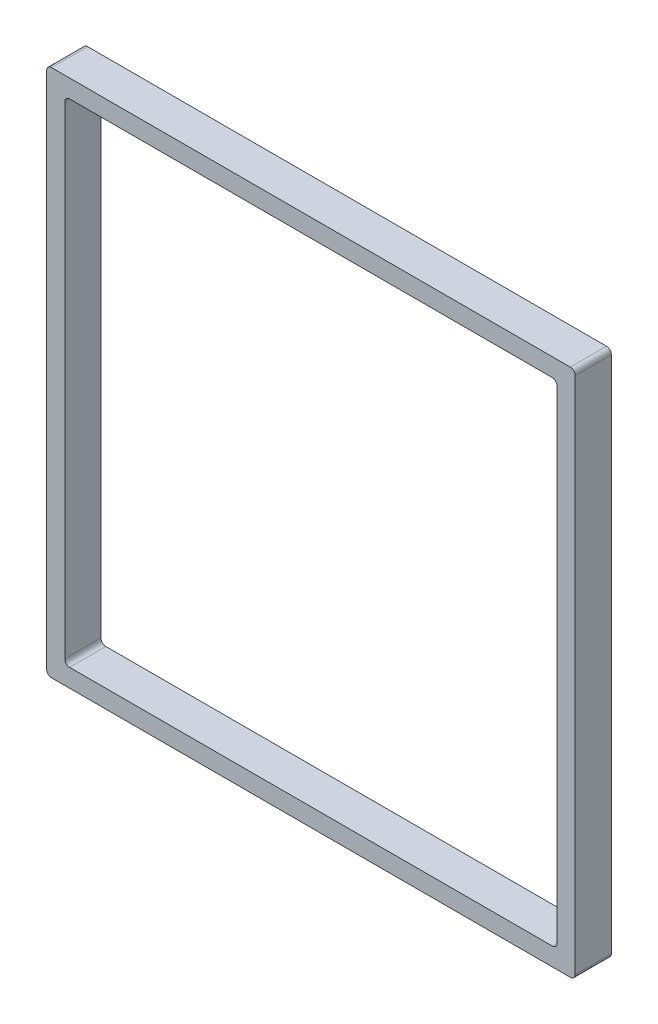
ISO-10303-21;
HEADER;
FILE_DESCRIPTION(('STEP AP214'),'2;1');
FILE_NAME('part.step','',(''),(''),'','','');
FILE_SCHEMA(('AUTOMOTIVE_DESIGN { 1 0 10303 214 1 1 1 1 }'));
ENDSEC;
DATA;
#1=APPLICATION_CONTEXT('core data for automotive mechanical design processes');
#2=APPLICATION_PROTOCOL_DEFINITION('international standard','automotive_design',2000,#1);
#3=PRODUCT_CONTEXT('',#1,'mechanical');
#4=PRODUCT('Part','Part','',(#3));
#5=PRODUCT_RELATED_PRODUCT_CATEGORY('part','',(#4));
#6=PRODUCT_DEFINITION_FORMATION('','',#4);
#7=PRODUCT_DEFINITION_CONTEXT('part definition',#1,'design');
#8=PRODUCT_DEFINITION('design','',#6,#7);
#9=PRODUCT_DEFINITION_SHAPE('','',#8);
#10=(LENGTH_UNIT() NAMED_UNIT(*) SI_UNIT(.MILLI.,.METRE.));
#11=(NAMED_UNIT(*) PLANE_ANGLE_UNIT() SI_UNIT($,.RADIAN.));
#12=(NAMED_UNIT(*) SI_UNIT($,.STERADIAN.) SOLID_ANGLE_UNIT());
#13=UNCERTAINTY_MEASURE_WITH_UNIT(LENGTH_MEASURE(1.E-05),#10,'distance_accuracy_value','');
#14=(GEOMETRIC_REPRESENTATION_CONTEXT(3) GLOBAL_UNCERTAINTY_ASSIGNED_CONTEXT((#13)) GLOBAL_UNIT_ASSIGNED_CONTEXT((#10,
#11,#12)) REPRESENTATION_CONTEXT('',''));
#15=CARTESIAN_POINT('',(0.,0.,0.));
#16=DIRECTION('',(0.,0.,1.));
#17=DIRECTION('',(1.,0.,0.));
#18=AXIS2_PLACEMENT_3D('',#15,#16,#17);
#19=CARTESIAN_POINT('',(139.065,139.065,19.05));
#20=DIRECTION('',(0.,0.,-1.));
#21=DIRECTION('',(-1.,0.,0.));
#22=AXIS2_PLACEMENT_3D('',#19,#20,#21);
#23=PLANE('',#22);
#24=DIRECTION('',(1.,0.,0.));
#25=VECTOR('',#24,1.);
#26=CARTESIAN_POINT('',(-139.065,-139.065,19.05));
#27=LINE('',#26,#25);
#28=CARTESIAN_POINT('',(-136.525,-139.065,19.05));
#29=VERTEX_POINT('',#28);
#30=CARTESIAN_POINT('',(136.525,-139.065,19.05));
#31=VERTEX_POINT('',#30);
#32=EDGE_CURVE('E172',#29,#31,#27,.T.);
#33=ORIENTED_EDGE('',*,*,#32,.T.);
#34=CARTESIAN_POINT('',(136.525,-136.525,19.05));
#35=DIRECTION('',(0.,0.,-1.));
#36=DIRECTION('',(-1.,0.,0.));
#37=AXIS2_PLACEMENT_3D('',#34,#35,#36);
#38=CIRCLE('',#37,2.54);
#39=CARTESIAN_POINT('',(139.065,-136.525,19.05));
#40=VERTEX_POINT('',#39);
#41=EDGE_CURVE('E219',#31,#40,#38,.F.);
#42=ORIENTED_EDGE('',*,*,#41,.T.);
#43=DIRECTION('',(0.,1.,0.));
#44=VECTOR('',#43,1.);
#45=CARTESIAN_POINT('',(139.065,-139.065,19.05));
#46=LINE('',#45,#44);
#47=CARTESIAN_POINT('',(139.065,136.525,19.05));
#48=VERTEX_POINT('',#47);
#49=EDGE_CURVE('E272',#40,#48,#46,.T.);
#50=ORIENTED_EDGE('',*,*,#49,.T.);
#51=CARTESIAN_POINT('',(136.525,136.525,19.05));
#52=DIRECTION('',(0.,0.,-1.));
#53=DIRECTION('',(-1.,0.,0.));
#54=AXIS2_PLACEMENT_3D('',#51,#52,#53);
#55=CIRCLE('',#54,2.54);
#56=CARTESIAN_POINT('',(136.525,139.065,19.05));
#57=VERTEX_POINT('',#56);
#58=EDGE_CURVE('E214',#48,#57,#55,.F.);
#59=ORIENTED_EDGE('',*,*,#58,.T.);
#60=DIRECTION('',(-1.,0.,0.));
#61=VECTOR('',#60,1.);
#62=CARTESIAN_POINT('',(-139.065,139.065,19.05));
#63=LINE('',#62,#61);
#64=CARTESIAN_POINT('',(-136.525,139.065,19.05));
#65=VERTEX_POINT('',#64);
#66=EDGE_CURVE('E275',#57,#65,#63,.T.);
#67=ORIENTED_EDGE('',*,*,#66,.T.);
#68=CARTESIAN_POINT('',(-136.525,136.525,19.05));
#69=DIRECTION('',(0.,0.,-1.));
#70=DIRECTION('',(-1.,0.,0.));
#71=AXIS2_PLACEMENT_3D('',#68,#69,#70);
#72=CIRCLE('',#71,2.54);
#73=CARTESIAN_POINT('',(-139.065,136.525,19.05));
#74=VERTEX_POINT('',#73);
#75=EDGE_CURVE('E54',#65,#74,#72,.F.);
#76=ORIENTED_EDGE('',*,*,#75,.T.);
#77=DIRECTION('',(0.,-1.,0.));
#78=VECTOR('',#77,1.);
#79=CARTESIAN_POINT('',(-139.065,-139.065,19.05));
#80=LINE('',#79,#78);
#81=CARTESIAN_POINT('',(-139.065,-136.525,19.05));
#82=VERTEX_POINT('',#81);
#83=EDGE_CURVE('E177',#74,#82,#80,.T.);
#84=ORIENTED_EDGE('',*,*,#83,.T.);
#85=CARTESIAN_POINT('',(-136.525,-136.525,19.05));
#86=DIRECTION('',(0.,0.,-1.));
#87=DIRECTION('',(-1.,0.,0.));
#88=AXIS2_PLACEMENT_3D('',#85,#86,#87);
#89=CIRCLE('',#88,2.54);
#90=EDGE_CURVE('E217',#82,#29,#89,.F.);
#91=ORIENTED_EDGE('',*,*,#90,.T.);
#92=EDGE_LOOP('',(#33,#42,#50,#59,#67,#76,#84,#91));
#93=FACE_BOUND('',#92,.T.);
#94=DIRECTION('',(0.,1.,0.));
#95=VECTOR('',#94,1.);
#96=CARTESIAN_POINT('',(129.54,-129.54,19.05));
#97=LINE('',#96,#95);
#98=CARTESIAN_POINT('',(129.54,-127.,19.05));
#99=VERTEX_POINT('',#98);
#100=CARTESIAN_POINT('',(129.54,127.,19.05));
#101=VERTEX_POINT('',#100);
#102=EDGE_CURVE('E261',#99,#101,#97,.T.);
#103=ORIENTED_EDGE('',*,*,#102,.F.);
#104=CARTESIAN_POINT('',(127.,-127.,19.05));
#105=DIRECTION('',(0.,0.,-1.));
#106=DIRECTION('',(-1.,0.,0.));
#107=AXIS2_PLACEMENT_3D('',#104,#105,#106);
#108=CIRCLE('',#107,2.54);
#109=CARTESIAN_POINT('',(127.,-129.54,19.05));
#110=VERTEX_POINT('',#109);
#111=EDGE_CURVE('E157',#99,#110,#108,.T.);
#112=ORIENTED_EDGE('',*,*,#111,.T.);
#113=DIRECTION('',(1.,0.,0.));
#114=VECTOR('',#113,1.);
#115=CARTESIAN_POINT('',(-129.54,-129.54,19.05));
#116=LINE('',#115,#114);
#117=CARTESIAN_POINT('',(-127.,-129.54,19.05));
#118=VERTEX_POINT('',#117);
#119=EDGE_CURVE('E263',#118,#110,#116,.T.);
#120=ORIENTED_EDGE('',*,*,#119,.F.);
#121=CARTESIAN_POINT('',(-127.,-127.,19.05));
#122=DIRECTION('',(0.,0.,-1.));
#123=DIRECTION('',(-1.,0.,0.));
#124=AXIS2_PLACEMENT_3D('',#121,#122,#123);
#125=CIRCLE('',#124,2.54);
#126=CARTESIAN_POINT('',(-129.54,-127.,19.05));
#127=VERTEX_POINT('',#126);
#128=EDGE_CURVE('E236',#118,#127,#125,.T.);
#129=ORIENTED_EDGE('',*,*,#128,.T.);
#130=DIRECTION('',(0.,-1.,0.));
#131=VECTOR('',#130,1.);
#132=CARTESIAN_POINT('',(-129.54,-129.54,19.05));
#133=LINE('',#132,#131);
#134=CARTESIAN_POINT('',(-129.54,127.,19.05));
#135=VERTEX_POINT('',#134);
#136=EDGE_CURVE('E257',#135,#127,#133,.T.);
#137=ORIENTED_EDGE('',*,*,#136,.F.);
#138=CARTESIAN_POINT('',(-127.,127.,19.05));
#139=DIRECTION('',(0.,0.,-1.));
#140=DIRECTION('',(-1.,0.,0.));
#141=AXIS2_PLACEMENT_3D('',#138,#139,#140);
#142=CIRCLE('',#141,2.54);
#143=CARTESIAN_POINT('',(-127.,129.54,19.05));
#144=VERTEX_POINT('',#143);
#145=EDGE_CURVE('E11',#135,#144,#142,.T.);
#146=ORIENTED_EDGE('',*,*,#145,.T.);
#147=DIRECTION('',(-1.,0.,0.));
#148=VECTOR('',#147,1.);
#149=CARTESIAN_POINT('',(-129.54,129.54,19.05));
#150=LINE('',#149,#148);
#151=CARTESIAN_POINT('',(127.,129.54,19.05));
#152=VERTEX_POINT('',#151);
#153=EDGE_CURVE('E255',#152,#144,#150,.T.);
#154=ORIENTED_EDGE('',*,*,#153,.F.);
#155=CARTESIAN_POINT('',(127.,127.,19.05));
#156=DIRECTION('',(0.,0.,-1.));
#157=DIRECTION('',(-1.,0.,0.));
#158=AXIS2_PLACEMENT_3D('',#155,#156,#157);
#159=CIRCLE('',#158,2.54);
#160=EDGE_CURVE('E158',#152,#101,#159,.T.);
#161=ORIENTED_EDGE('',*,*,#160,.T.);
#162=EDGE_LOOP('',(#103,#112,#120,#129,#137,#146,#154,#161));
#163=FACE_BOUND('',#162,.T.);
#164=ADVANCED_FACE('F32',(#93,#163),#23,.F.);
#165=CARTESIAN_POINT('',(139.065,139.065,0.));
#166=DIRECTION('',(0.,0.,-1.));
#167=DIRECTION('',(-1.,0.,0.));
#168=AXIS2_PLACEMENT_3D('',#165,#166,#167);
#169=PLANE('',#168);
#170=DIRECTION('',(0.,1.,0.));
#171=VECTOR('',#170,1.);
#172=CARTESIAN_POINT('',(139.065,-139.065,0.));
#173=LINE('',#172,#171);
#174=CARTESIAN_POINT('',(139.065,-136.525,0.));
#175=VERTEX_POINT('',#174);
#176=CARTESIAN_POINT('',(139.065,136.525,0.));
#177=VERTEX_POINT('',#176);
#178=EDGE_CURVE('E268',#175,#177,#173,.T.);
#179=ORIENTED_EDGE('',*,*,#178,.F.);
#180=CARTESIAN_POINT('',(136.525,-136.525,0.));
#181=DIRECTION('',(0.,0.,-1.));
#182=DIRECTION('',(-1.,0.,0.));
#183=AXIS2_PLACEMENT_3D('',#180,#181,#182);
#184=CIRCLE('',#183,2.54);
#185=CARTESIAN_POINT('',(136.525,-139.065,0.));
#186=VERTEX_POINT('',#185);
#187=EDGE_CURVE('E207',#175,#186,#184,.T.);
#188=ORIENTED_EDGE('',*,*,#187,.T.);
#189=DIRECTION('',(1.,0.,0.));
#190=VECTOR('',#189,1.);
#191=CARTESIAN_POINT('',(-139.065,-139.065,0.));
#192=LINE('',#191,#190);
#193=CARTESIAN_POINT('',(-136.525,-139.065,0.));
#194=VERTEX_POINT('',#193);
#195=EDGE_CURVE('E180',#194,#186,#192,.T.);
#196=ORIENTED_EDGE('',*,*,#195,.F.);
#197=CARTESIAN_POINT('',(-136.525,-136.525,0.));
#198=DIRECTION('',(0.,0.,-1.));
#199=DIRECTION('',(-1.,0.,0.));
#200=AXIS2_PLACEMENT_3D('',#197,#198,#199);
#201=CIRCLE('',#200,2.54);
#202=CARTESIAN_POINT('',(-139.065,-136.525,0.));
#203=VERTEX_POINT('',#202);
#204=EDGE_CURVE('E205',#194,#203,#201,.T.);
#205=ORIENTED_EDGE('',*,*,#204,.T.);
#206=DIRECTION('',(0.,-1.,0.));
#207=VECTOR('',#206,1.);
#208=CARTESIAN_POINT('',(-139.065,-139.065,0.));
#209=LINE('',#208,#207);
#210=CARTESIAN_POINT('',(-139.065,136.525,0.));
#211=VERTEX_POINT('',#210);
#212=EDGE_CURVE('E282',#211,#203,#209,.T.);
#213=ORIENTED_EDGE('',*,*,#212,.F.);
#214=CARTESIAN_POINT('',(-136.525,136.525,0.));
#215=DIRECTION('',(0.,0.,-1.));
#216=DIRECTION('',(-1.,0.,0.));
#217=AXIS2_PLACEMENT_3D('',#214,#215,#216);
#218=CIRCLE('',#217,2.54);
#219=CARTESIAN_POINT('',(-136.525,139.065,0.));
#220=VERTEX_POINT('',#219);
#221=EDGE_CURVE('E203',#211,#220,#218,.T.);
#222=ORIENTED_EDGE('',*,*,#221,.T.);
#223=DIRECTION('',(-1.,0.,0.));
#224=VECTOR('',#223,1.);
#225=CARTESIAN_POINT('',(-139.065,139.065,0.));
#226=LINE('',#225,#224);
#227=CARTESIAN_POINT('',(136.525,139.065,0.));
#228=VERTEX_POINT('',#227);
#229=EDGE_CURVE('E280',#228,#220,#226,.T.);
#230=ORIENTED_EDGE('',*,*,#229,.F.);
#231=CARTESIAN_POINT('',(136.525,136.525,0.));
#232=DIRECTION('',(0.,0.,-1.));
#233=DIRECTION('',(-1.,0.,0.));
#234=AXIS2_PLACEMENT_3D('',#231,#232,#233);
#235=CIRCLE('',#234,2.54);
#236=EDGE_CURVE('E201',#228,#177,#235,.T.);
#237=ORIENTED_EDGE('',*,*,#236,.T.);
#238=EDGE_LOOP('',(#179,#188,#196,#205,#213,#222,#230,#237));
#239=FACE_BOUND('',#238,.T.);
#240=DIRECTION('',(0.,-1.,0.));
#241=VECTOR('',#240,1.);
#242=CARTESIAN_POINT('',(-129.54,-129.54,0.));
#243=LINE('',#242,#241);
#244=CARTESIAN_POINT('',(-129.54,127.,0.));
#245=VERTEX_POINT('',#244);
#246=CARTESIAN_POINT('',(-129.54,-127.,0.));
#247=VERTEX_POINT('',#246);
#248=EDGE_CURVE('E239',#245,#247,#243,.T.);
#249=ORIENTED_EDGE('',*,*,#248,.T.);
#250=CARTESIAN_POINT('',(-127.,-127.,0.));
#251=DIRECTION('',(0.,0.,-1.));
#252=DIRECTION('',(-1.,0.,0.));
#253=AXIS2_PLACEMENT_3D('',#250,#251,#252);
#254=CIRCLE('',#253,2.54);
#255=CARTESIAN_POINT('',(-127.,-129.54,0.));
#256=VERTEX_POINT('',#255);
#257=EDGE_CURVE('E234',#247,#256,#254,.F.);
#258=ORIENTED_EDGE('',*,*,#257,.T.);
#259=DIRECTION('',(1.,0.,0.));
#260=VECTOR('',#259,1.);
#261=CARTESIAN_POINT('',(-129.54,-129.54,0.));
#262=LINE('',#261,#260);
#263=CARTESIAN_POINT('',(127.,-129.54,0.));
#264=VERTEX_POINT('',#263);
#265=EDGE_CURVE('E152',#256,#264,#262,.T.);
#266=ORIENTED_EDGE('',*,*,#265,.T.);
#267=CARTESIAN_POINT('',(127.,-127.,0.));
#268=DIRECTION('',(0.,0.,-1.));
#269=DIRECTION('',(-1.,0.,0.));
#270=AXIS2_PLACEMENT_3D('',#267,#268,#269);
#271=CIRCLE('',#270,2.54);
#272=CARTESIAN_POINT('',(129.54,-127.,0.));
#273=VERTEX_POINT('',#272);
#274=EDGE_CURVE('E146',#264,#273,#271,.F.);
#275=ORIENTED_EDGE('',*,*,#274,.T.);
#276=DIRECTION('',(0.,1.,0.));
#277=VECTOR('',#276,1.);
#278=CARTESIAN_POINT('',(129.54,-129.54,0.));
#279=LINE('',#278,#277);
#280=CARTESIAN_POINT('',(129.54,127.,0.));
#281=VERTEX_POINT('',#280);
#282=EDGE_CURVE('E150',#273,#281,#279,.T.);
#283=ORIENTED_EDGE('',*,*,#282,.T.);
#284=CARTESIAN_POINT('',(127.,127.,0.));
#285=DIRECTION('',(0.,0.,-1.));
#286=DIRECTION('',(-1.,0.,0.));
#287=AXIS2_PLACEMENT_3D('',#284,#285,#286);
#288=CIRCLE('',#287,2.54);
#289=CARTESIAN_POINT('',(127.,129.54,0.));
#290=VERTEX_POINT('',#289);
#291=EDGE_CURVE('E230',#281,#290,#288,.F.);
#292=ORIENTED_EDGE('',*,*,#291,.T.);
#293=DIRECTION('',(-1.,0.,0.));
#294=VECTOR('',#293,1.);
#295=CARTESIAN_POINT('',(-129.54,129.54,0.));
#296=LINE('',#295,#294);
#297=CARTESIAN_POINT('',(-127.,129.54,0.));
#298=VERTEX_POINT('',#297);
#299=EDGE_CURVE('E168',#290,#298,#296,.T.);
#300=ORIENTED_EDGE('',*,*,#299,.T.);
#301=CARTESIAN_POINT('',(-127.,127.,0.));
#302=DIRECTION('',(0.,0.,-1.));
#303=DIRECTION('',(-1.,0.,0.));
#304=AXIS2_PLACEMENT_3D('',#301,#302,#303);
#305=CIRCLE('',#304,2.54);
#306=EDGE_CURVE('E40',#298,#245,#305,.F.);
#307=ORIENTED_EDGE('',*,*,#306,.T.);
#308=EDGE_LOOP('',(#249,#258,#266,#275,#283,#292,#300,#307));
#309=FACE_BOUND('',#308,.T.);
#310=ADVANCED_FACE('F149',(#239,#309),#169,.T.);
#311=CARTESIAN_POINT('',(139.065,-139.065,19.05));
#312=DIRECTION('',(-1.,0.,0.));
#313=DIRECTION('',(0.,0.,1.));
#314=AXIS2_PLACEMENT_3D('',#311,#312,#313);
#315=PLANE('',#314);
#316=ORIENTED_EDGE('',*,*,#49,.F.);
#317=DIRECTION('',(0.,0.,-1.));
#318=VECTOR('',#317,1.);
#319=CARTESIAN_POINT('',(139.065,-136.525,19.05));
#320=LINE('',#319,#318);
#321=EDGE_CURVE('E198',#40,#175,#320,.T.);
#322=ORIENTED_EDGE('',*,*,#321,.T.);
#323=ORIENTED_EDGE('',*,*,#178,.T.);
#324=DIRECTION('',(0.,0.,-1.));
#325=VECTOR('',#324,1.);
#326=CARTESIAN_POINT('',(139.065,136.525,19.05));
#327=LINE('',#326,#325);
#328=EDGE_CURVE('E196',#177,#48,#327,.F.);
#329=ORIENTED_EDGE('',*,*,#328,.T.);
#330=EDGE_LOOP('',(#316,#322,#323,#329));
#331=FACE_BOUND('',#330,.T.);
#332=ADVANCED_FACE('F299',(#331),#315,.F.);
#333=CARTESIAN_POINT('',(-139.065,139.065,19.05));
#334=DIRECTION('',(0.,-1.,0.));
#335=DIRECTION('',(0.,0.,-1.));
#336=AXIS2_PLACEMENT_3D('',#333,#334,#335);
#337=PLANE('',#336);
#338=ORIENTED_EDGE('',*,*,#229,.T.);
#339=DIRECTION('',(0.,0.,-1.));
#340=VECTOR('',#339,1.);
#341=CARTESIAN_POINT('',(-136.525,139.065,19.05));
#342=LINE('',#341,#340);
#343=EDGE_CURVE('E228',#220,#65,#342,.F.);
#344=ORIENTED_EDGE('',*,*,#343,.T.);
#345=ORIENTED_EDGE('',*,*,#66,.F.);
#346=DIRECTION('',(0.,0.,-1.));
#347=VECTOR('',#346,1.);
#348=CARTESIAN_POINT('',(136.525,139.065,19.05));
#349=LINE('',#348,#347);
#350=EDGE_CURVE('E225',#57,#228,#349,.T.);
#351=ORIENTED_EDGE('',*,*,#350,.T.);
#352=EDGE_LOOP('',(#338,#344,#345,#351));
#353=FACE_BOUND('',#352,.T.);
#354=ADVANCED_FACE('F306',(#353),#337,.F.);
#355=CARTESIAN_POINT('',(-139.065,-139.065,19.05));
#356=DIRECTION('',(1.,0.,0.));
#357=DIRECTION('',(0.,0.,-1.));
#358=AXIS2_PLACEMENT_3D('',#355,#356,#357);
#359=PLANE('',#358);
#360=ORIENTED_EDGE('',*,*,#212,.T.);
#361=DIRECTION('',(0.,0.,-1.));
#362=VECTOR('',#361,1.);
#363=CARTESIAN_POINT('',(-139.065,-136.525,19.05));
#364=LINE('',#363,#362);
#365=EDGE_CURVE('E47',#203,#82,#364,.F.);
#366=ORIENTED_EDGE('',*,*,#365,.T.);
#367=ORIENTED_EDGE('',*,*,#83,.F.);
#368=DIRECTION('',(0.,0.,-1.));
#369=VECTOR('',#368,1.);
#370=CARTESIAN_POINT('',(-139.065,136.525,19.05));
#371=LINE('',#370,#369);
#372=EDGE_CURVE('E221',#74,#211,#371,.T.);
#373=ORIENTED_EDGE('',*,*,#372,.T.);
#374=EDGE_LOOP('',(#360,#366,#367,#373));
#375=FACE_BOUND('',#374,.T.);
#376=ADVANCED_FACE('F312',(#375),#359,.F.);
#377=CARTESIAN_POINT('',(-139.065,-139.065,19.05));
#378=DIRECTION('',(0.,1.,0.));
#379=DIRECTION('',(0.,0.,1.));
#380=AXIS2_PLACEMENT_3D('',#377,#378,#379);
#381=PLANE('',#380);
#382=ORIENTED_EDGE('',*,*,#195,.T.);
#383=DIRECTION('',(0.,0.,-1.));
#384=VECTOR('',#383,1.);
#385=CARTESIAN_POINT('',(136.525,-139.065,19.05));
#386=LINE('',#385,#384);
#387=EDGE_CURVE('E212',#186,#31,#386,.F.);
#388=ORIENTED_EDGE('',*,*,#387,.T.);
#389=ORIENTED_EDGE('',*,*,#32,.F.);
#390=DIRECTION('',(0.,0.,-1.));
#391=VECTOR('',#390,1.);
#392=CARTESIAN_POINT('',(-136.525,-139.065,19.05));
#393=LINE('',#392,#391);
#394=EDGE_CURVE('E209',#29,#194,#393,.T.);
#395=ORIENTED_EDGE('',*,*,#394,.T.);
#396=EDGE_LOOP('',(#382,#388,#389,#395));
#397=FACE_BOUND('',#396,.T.);
#398=ADVANCED_FACE('F288',(#397),#381,.F.);
#399=CARTESIAN_POINT('',(129.54,-129.54,19.05));
#400=DIRECTION('',(-1.,0.,0.));
#401=DIRECTION('',(0.,0.,1.));
#402=AXIS2_PLACEMENT_3D('',#399,#400,#401);
#403=PLANE('',#402);
#404=ORIENTED_EDGE('',*,*,#102,.T.);
#405=DIRECTION('',(0.,0.,-1.));
#406=VECTOR('',#405,1.);
#407=CARTESIAN_POINT('',(129.54,127.,0.));
#408=LINE('',#407,#406);
#409=EDGE_CURVE('E167',#101,#281,#408,.T.);
#410=ORIENTED_EDGE('',*,*,#409,.T.);
#411=ORIENTED_EDGE('',*,*,#282,.F.);
#412=DIRECTION('',(0.,0.,-1.));
#413=VECTOR('',#412,1.);
#414=CARTESIAN_POINT('',(129.54,-127.,19.05));
#415=LINE('',#414,#413);
#416=EDGE_CURVE('E164',#273,#99,#415,.F.);
#417=ORIENTED_EDGE('',*,*,#416,.T.);
#418=EDGE_LOOP('',(#404,#410,#411,#417));
#419=FACE_BOUND('',#418,.T.);
#420=ADVANCED_FACE('F163',(#419),#403,.T.);
#421=CARTESIAN_POINT('',(-129.54,129.54,19.05));
#422=DIRECTION('',(0.,-1.,0.));
#423=DIRECTION('',(0.,0.,-1.));
#424=AXIS2_PLACEMENT_3D('',#421,#422,#423);
#425=PLANE('',#424);
#426=ORIENTED_EDGE('',*,*,#299,.F.);
#427=DIRECTION('',(0.,0.,-1.));
#428=VECTOR('',#427,1.);
#429=CARTESIAN_POINT('',(127.,129.54,19.05));
#430=LINE('',#429,#428);
#431=EDGE_CURVE('E185',#290,#152,#430,.F.);
#432=ORIENTED_EDGE('',*,*,#431,.T.);
#433=ORIENTED_EDGE('',*,*,#153,.T.);
#434=DIRECTION('',(0.,0.,-1.));
#435=VECTOR('',#434,1.);
#436=CARTESIAN_POINT('',(-127.,129.54,0.));
#437=LINE('',#436,#435);
#438=EDGE_CURVE('E174',#144,#298,#437,.T.);
#439=ORIENTED_EDGE('',*,*,#438,.T.);
#440=EDGE_LOOP('',(#426,#432,#433,#439));
#441=FACE_BOUND('',#440,.T.);
#442=ADVANCED_FACE('F259',(#441),#425,.T.);
#443=CARTESIAN_POINT('',(-129.54,-129.54,19.05));
#444=DIRECTION('',(1.,0.,0.));
#445=DIRECTION('',(0.,0.,-1.));
#446=AXIS2_PLACEMENT_3D('',#443,#444,#445);
#447=PLANE('',#446);
#448=ORIENTED_EDGE('',*,*,#136,.T.);
#449=DIRECTION('',(0.,0.,-1.));
#450=VECTOR('',#449,1.);
#451=CARTESIAN_POINT('',(-129.54,-127.,0.));
#452=LINE('',#451,#450);
#453=EDGE_CURVE('E193',#127,#247,#452,.T.);
#454=ORIENTED_EDGE('',*,*,#453,.T.);
#455=ORIENTED_EDGE('',*,*,#248,.F.);
#456=DIRECTION('',(0.,0.,-1.));
#457=VECTOR('',#456,1.);
#458=CARTESIAN_POINT('',(-129.54,127.,19.05));
#459=LINE('',#458,#457);
#460=EDGE_CURVE('E191',#245,#135,#459,.F.);
#461=ORIENTED_EDGE('',*,*,#460,.T.);
#462=EDGE_LOOP('',(#448,#454,#455,#461));
#463=FACE_BOUND('',#462,.T.);
#464=ADVANCED_FACE('F246',(#463),#447,.T.);
#465=CARTESIAN_POINT('',(-129.54,-129.54,19.05));
#466=DIRECTION('',(0.,1.,0.));
#467=DIRECTION('',(0.,0.,1.));
#468=AXIS2_PLACEMENT_3D('',#465,#466,#467);
#469=PLANE('',#468);
#470=ORIENTED_EDGE('',*,*,#119,.T.);
#471=DIRECTION('',(0.,0.,-1.));
#472=VECTOR('',#471,1.);
#473=CARTESIAN_POINT('',(127.,-129.54,0.));
#474=LINE('',#473,#472);
#475=EDGE_CURVE('E189',#110,#264,#474,.T.);
#476=ORIENTED_EDGE('',*,*,#475,.T.);
#477=ORIENTED_EDGE('',*,*,#265,.F.);
#478=DIRECTION('',(0.,0.,-1.));
#479=VECTOR('',#478,1.);
#480=CARTESIAN_POINT('',(-127.,-129.54,19.05));
#481=LINE('',#480,#479);
#482=EDGE_CURVE('E187',#256,#118,#481,.F.);
#483=ORIENTED_EDGE('',*,*,#482,.T.);
#484=EDGE_LOOP('',(#470,#476,#477,#483));
#485=FACE_BOUND('',#484,.T.);
#486=ADVANCED_FACE('F343',(#485),#469,.T.);
#487=CARTESIAN_POINT('',(127.,127.,19.05));
#488=DIRECTION('',(0.,0.,1.));
#489=DIRECTION('',(1.,0.,0.));
#490=AXIS2_PLACEMENT_3D('',#487,#488,#489);
#491=CYLINDRICAL_SURFACE('',#490,2.54);
#492=ORIENTED_EDGE('',*,*,#160,.F.);
#493=ORIENTED_EDGE('',*,*,#431,.F.);
#494=ORIENTED_EDGE('',*,*,#291,.F.);
#495=ORIENTED_EDGE('',*,*,#409,.F.);
#496=EDGE_LOOP('',(#492,#493,#494,#495));
#497=FACE_BOUND('',#496,.T.);
#498=ADVANCED_FACE('F340',(#497),#491,.F.);
#499=CARTESIAN_POINT('',(127.,-127.,19.05));
#500=DIRECTION('',(0.,0.,1.));
#501=DIRECTION('',(1.,0.,0.));
#502=AXIS2_PLACEMENT_3D('',#499,#500,#501);
#503=CYLINDRICAL_SURFACE('',#502,2.54);
#504=ORIENTED_EDGE('',*,*,#111,.F.);
#505=ORIENTED_EDGE('',*,*,#416,.F.);
#506=ORIENTED_EDGE('',*,*,#274,.F.);
#507=ORIENTED_EDGE('',*,*,#475,.F.);
#508=EDGE_LOOP('',(#504,#505,#506,#507));
#509=FACE_BOUND('',#508,.T.);
#510=ADVANCED_FACE('F171',(#509),#503,.F.);
#511=CARTESIAN_POINT('',(-127.,-127.,19.05));
#512=DIRECTION('',(0.,0.,1.));
#513=DIRECTION('',(1.,0.,0.));
#514=AXIS2_PLACEMENT_3D('',#511,#512,#513);
#515=CYLINDRICAL_SURFACE('',#514,2.54);
#516=ORIENTED_EDGE('',*,*,#128,.F.);
#517=ORIENTED_EDGE('',*,*,#482,.F.);
#518=ORIENTED_EDGE('',*,*,#257,.F.);
#519=ORIENTED_EDGE('',*,*,#453,.F.);
#520=EDGE_LOOP('',(#516,#517,#518,#519));
#521=FACE_BOUND('',#520,.T.);
#522=ADVANCED_FACE('F347',(#521),#515,.F.);
#523=CARTESIAN_POINT('',(-127.,127.,19.05));
#524=DIRECTION('',(0.,0.,1.));
#525=DIRECTION('',(1.,0.,0.));
#526=AXIS2_PLACEMENT_3D('',#523,#524,#525);
#527=CYLINDRICAL_SURFACE('',#526,2.54);
#528=ORIENTED_EDGE('',*,*,#145,.F.);
#529=ORIENTED_EDGE('',*,*,#460,.F.);
#530=ORIENTED_EDGE('',*,*,#306,.F.);
#531=ORIENTED_EDGE('',*,*,#438,.F.);
#532=EDGE_LOOP('',(#528,#529,#530,#531));
#533=FACE_BOUND('',#532,.T.);
#534=ADVANCED_FACE('F251',(#533),#527,.F.);
#535=CARTESIAN_POINT('',(136.525,-136.525,19.05));
#536=DIRECTION('',(0.,0.,-1.));
#537=DIRECTION('',(-1.,0.,0.));
#538=AXIS2_PLACEMENT_3D('',#535,#536,#537);
#539=CYLINDRICAL_SURFACE('',#538,2.54);
#540=ORIENTED_EDGE('',*,*,#41,.F.);
#541=ORIENTED_EDGE('',*,*,#387,.F.);
#542=ORIENTED_EDGE('',*,*,#187,.F.);
#543=ORIENTED_EDGE('',*,*,#321,.F.);
#544=EDGE_LOOP('',(#540,#541,#542,#543));
#545=FACE_BOUND('',#544,.T.);
#546=ADVANCED_FACE('F294',(#545),#539,.T.);
#547=CARTESIAN_POINT('',(-136.525,-136.525,19.05));
#548=DIRECTION('',(0.,0.,-1.));
#549=DIRECTION('',(-1.,0.,0.));
#550=AXIS2_PLACEMENT_3D('',#547,#548,#549);
#551=CYLINDRICAL_SURFACE('',#550,2.54);
#552=ORIENTED_EDGE('',*,*,#90,.F.);
#553=ORIENTED_EDGE('',*,*,#365,.F.);
#554=ORIENTED_EDGE('',*,*,#204,.F.);
#555=ORIENTED_EDGE('',*,*,#394,.F.);
#556=EDGE_LOOP('',(#552,#553,#554,#555));
#557=FACE_BOUND('',#556,.T.);
#558=ADVANCED_FACE('F315',(#557),#551,.T.);
#559=CARTESIAN_POINT('',(-136.525,136.525,19.05));
#560=DIRECTION('',(0.,0.,-1.));
#561=DIRECTION('',(-1.,0.,0.));
#562=AXIS2_PLACEMENT_3D('',#559,#560,#561);
#563=CYLINDRICAL_SURFACE('',#562,2.54);
#564=ORIENTED_EDGE('',*,*,#75,.F.);
#565=ORIENTED_EDGE('',*,*,#343,.F.);
#566=ORIENTED_EDGE('',*,*,#221,.F.);
#567=ORIENTED_EDGE('',*,*,#372,.F.);
#568=EDGE_LOOP('',(#564,#565,#566,#567));
#569=FACE_BOUND('',#568,.T.);
#570=ADVANCED_FACE('F310',(#569),#563,.T.);
#571=CARTESIAN_POINT('',(136.525,136.525,19.05));
#572=DIRECTION('',(0.,0.,-1.));
#573=DIRECTION('',(-1.,0.,0.));
#574=AXIS2_PLACEMENT_3D('',#571,#572,#573);
#575=CYLINDRICAL_SURFACE('',#574,2.54);
#576=ORIENTED_EDGE('',*,*,#58,.F.);
#577=ORIENTED_EDGE('',*,*,#328,.F.);
#578=ORIENTED_EDGE('',*,*,#236,.F.);
#579=ORIENTED_EDGE('',*,*,#350,.F.);
#580=EDGE_LOOP('',(#576,#577,#578,#579));
#581=FACE_BOUND('',#580,.T.);
#582=ADVANCED_FACE('F34',(#581),#575,.T.);
#583=CLOSED_SHELL('',(#164,#310,#332,#354,#376,#398,#420,#442,#464,#486,#498,#510,#522,#534,
#546,#558,#570,#582));
#584=MANIFOLD_SOLID_BREP('B2',#583);
#585=ADVANCED_BREP_SHAPE_REPRESENTATION('',(#18,#584),#14);
#586=SHAPE_DEFINITION_REPRESENTATION(#9,#585);
ENDSEC;
END-ISO-10303-21;
